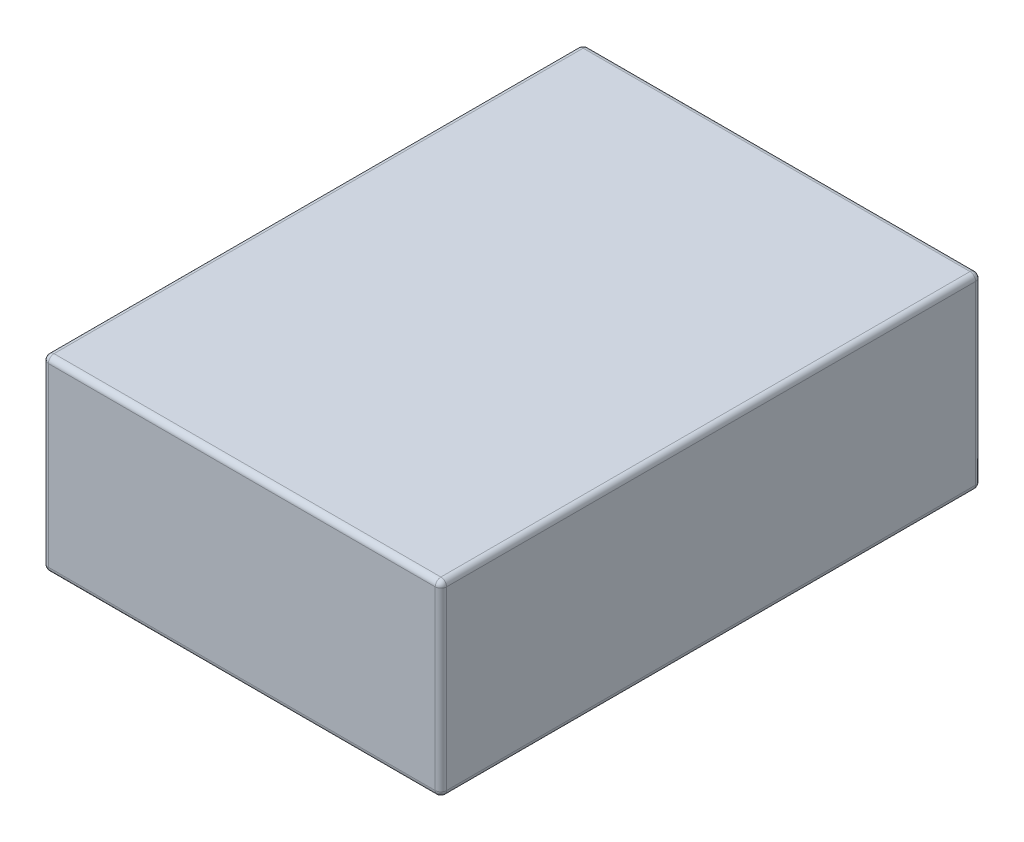
ISO-10303-21;
HEADER;
FILE_DESCRIPTION(('STEP AP214'),'2;1');
FILE_NAME('part.step','',(''),(''),'','','');
FILE_SCHEMA(('AUTOMOTIVE_DESIGN { 1 0 10303 214 1 1 1 1 }'));
ENDSEC;
DATA;
#1=APPLICATION_CONTEXT('core data for automotive mechanical design processes');
#2=APPLICATION_PROTOCOL_DEFINITION('international standard','automotive_design',2000,#1);
#3=PRODUCT_CONTEXT('',#1,'mechanical');
#4=PRODUCT('Part','Part','',(#3));
#5=PRODUCT_RELATED_PRODUCT_CATEGORY('part','',(#4));
#6=PRODUCT_DEFINITION_FORMATION('','',#4);
#7=PRODUCT_DEFINITION_CONTEXT('part definition',#1,'design');
#8=PRODUCT_DEFINITION('design','',#6,#7);
#9=PRODUCT_DEFINITION_SHAPE('','',#8);
#10=(LENGTH_UNIT() NAMED_UNIT(*) SI_UNIT(.MILLI.,.METRE.));
#11=(NAMED_UNIT(*) PLANE_ANGLE_UNIT() SI_UNIT($,.RADIAN.));
#12=(NAMED_UNIT(*) SI_UNIT($,.STERADIAN.) SOLID_ANGLE_UNIT());
#13=UNCERTAINTY_MEASURE_WITH_UNIT(LENGTH_MEASURE(1.E-05),#10,'distance_accuracy_value','');
#14=(GEOMETRIC_REPRESENTATION_CONTEXT(3) GLOBAL_UNCERTAINTY_ASSIGNED_CONTEXT((#13)) GLOBAL_UNIT_ASSIGNED_CONTEXT((#10,
#11,#12)) REPRESENTATION_CONTEXT('',''));
#15=CARTESIAN_POINT('',(0.,0.,0.));
#16=DIRECTION('',(0.,0.,1.));
#17=DIRECTION('',(1.,0.,0.));
#18=AXIS2_PLACEMENT_3D('',#15,#16,#17);
#19=CARTESIAN_POINT('',(0.,33.,0.));
#20=DIRECTION('',(1.,0.,0.));
#21=DIRECTION('',(0.,0.,-1.));
#22=AXIS2_PLACEMENT_3D('',#19,#20,#21);
#23=PLANE('',#22);
#24=DIRECTION('',(0.,-1.,0.));
#25=VECTOR('',#24,1.);
#26=CARTESIAN_POINT('',(0.,33.,-1.));
#27=LINE('',#26,#25);
#28=CARTESIAN_POINT('',(0.,1.,-1.));
#29=VERTEX_POINT('',#28);
#30=CARTESIAN_POINT('',(0.,32.,-1.));
#31=VERTEX_POINT('',#30);
#32=EDGE_CURVE('E140',#29,#31,#27,.F.);
#33=ORIENTED_EDGE('',*,*,#32,.T.);
#34=DIRECTION('',(0.,0.,1.));
#35=VECTOR('',#34,1.);
#36=CARTESIAN_POINT('',(0.,32.,0.));
#37=LINE('',#36,#35);
#38=CARTESIAN_POINT('',(0.,32.,-94.));
#39=VERTEX_POINT('',#38);
#40=EDGE_CURVE('E186',#31,#39,#37,.F.);
#41=ORIENTED_EDGE('',*,*,#40,.T.);
#42=DIRECTION('',(0.,-1.,0.));
#43=VECTOR('',#42,1.);
#44=CARTESIAN_POINT('',(0.,33.,-94.));
#45=LINE('',#44,#43);
#46=CARTESIAN_POINT('',(0.,1.,-94.));
#47=VERTEX_POINT('',#46);
#48=EDGE_CURVE('E181',#39,#47,#45,.T.);
#49=ORIENTED_EDGE('',*,*,#48,.T.);
#50=DIRECTION('',(0.,0.,1.));
#51=VECTOR('',#50,1.);
#52=CARTESIAN_POINT('',(0.,1.,0.));
#53=LINE('',#52,#51);
#54=EDGE_CURVE('E175',#47,#29,#53,.T.);
#55=ORIENTED_EDGE('',*,*,#54,.T.);
#56=EDGE_LOOP('',(#33,#41,#49,#55));
#57=FACE_BOUND('',#56,.T.);
#58=ADVANCED_FACE('F43',(#57),#23,.F.);
#59=CARTESIAN_POINT('',(0.,33.,0.));
#60=DIRECTION('',(0.,0.,-1.));
#61=DIRECTION('',(-1.,0.,0.));
#62=AXIS2_PLACEMENT_3D('',#59,#60,#61);
#63=PLANE('',#62);
#64=DIRECTION('',(0.,-1.,0.));
#65=VECTOR('',#64,1.);
#66=CARTESIAN_POINT('',(69.,33.,0.));
#67=LINE('',#66,#65);
#68=CARTESIAN_POINT('',(69.,1.,0.));
#69=VERTEX_POINT('',#68);
#70=CARTESIAN_POINT('',(69.,32.,0.));
#71=VERTEX_POINT('',#70);
#72=EDGE_CURVE('E165',#69,#71,#67,.F.);
#73=ORIENTED_EDGE('',*,*,#72,.T.);
#74=DIRECTION('',(1.,0.,0.));
#75=VECTOR('',#74,1.);
#76=CARTESIAN_POINT('',(0.,32.,0.));
#77=LINE('',#76,#75);
#78=CARTESIAN_POINT('',(1.,32.,0.));
#79=VERTEX_POINT('',#78);
#80=EDGE_CURVE('E169',#71,#79,#77,.F.);
#81=ORIENTED_EDGE('',*,*,#80,.T.);
#82=DIRECTION('',(0.,-1.,0.));
#83=VECTOR('',#82,1.);
#84=CARTESIAN_POINT('',(1.,33.,0.));
#85=LINE('',#84,#83);
#86=CARTESIAN_POINT('',(1.,1.,0.));
#87=VERTEX_POINT('',#86);
#88=EDGE_CURVE('E138',#79,#87,#85,.T.);
#89=ORIENTED_EDGE('',*,*,#88,.T.);
#90=DIRECTION('',(1.,0.,0.));
#91=VECTOR('',#90,1.);
#92=CARTESIAN_POINT('',(70.,1.,0.));
#93=LINE('',#92,#91);
#94=EDGE_CURVE('E158',#87,#69,#93,.T.);
#95=ORIENTED_EDGE('',*,*,#94,.T.);
#96=EDGE_LOOP('',(#73,#81,#89,#95));
#97=FACE_BOUND('',#96,.T.);
#98=ADVANCED_FACE('F167',(#97),#63,.F.);
#99=CARTESIAN_POINT('',(70.,33.,0.));
#100=DIRECTION('',(-1.,0.,0.));
#101=DIRECTION('',(0.,0.,1.));
#102=AXIS2_PLACEMENT_3D('',#99,#100,#101);
#103=PLANE('',#102);
#104=DIRECTION('',(0.,-1.,0.));
#105=VECTOR('',#104,1.);
#106=CARTESIAN_POINT('',(70.,33.,-94.));
#107=LINE('',#106,#105);
#108=CARTESIAN_POINT('',(70.,1.,-94.));
#109=VERTEX_POINT('',#108);
#110=CARTESIAN_POINT('',(70.,32.,-94.));
#111=VERTEX_POINT('',#110);
#112=EDGE_CURVE('E192',#109,#111,#107,.F.);
#113=ORIENTED_EDGE('',*,*,#112,.T.);
#114=DIRECTION('',(0.,0.,-1.));
#115=VECTOR('',#114,1.);
#116=CARTESIAN_POINT('',(70.,32.,0.));
#117=LINE('',#116,#115);
#118=CARTESIAN_POINT('',(70.,32.,-1.));
#119=VERTEX_POINT('',#118);
#120=EDGE_CURVE('E199',#111,#119,#117,.F.);
#121=ORIENTED_EDGE('',*,*,#120,.T.);
#122=DIRECTION('',(0.,-1.,0.));
#123=VECTOR('',#122,1.);
#124=CARTESIAN_POINT('',(70.,33.,-1.));
#125=LINE('',#124,#123);
#126=CARTESIAN_POINT('',(70.,1.,-1.));
#127=VERTEX_POINT('',#126);
#128=EDGE_CURVE('E195',#119,#127,#125,.T.);
#129=ORIENTED_EDGE('',*,*,#128,.T.);
#130=DIRECTION('',(0.,0.,-1.));
#131=VECTOR('',#130,1.);
#132=CARTESIAN_POINT('',(70.,1.,-95.));
#133=LINE('',#132,#131);
#134=EDGE_CURVE('E189',#127,#109,#133,.T.);
#135=ORIENTED_EDGE('',*,*,#134,.T.);
#136=EDGE_LOOP('',(#113,#121,#129,#135));
#137=FACE_BOUND('',#136,.T.);
#138=ADVANCED_FACE('F338',(#137),#103,.F.);
#139=CARTESIAN_POINT('',(0.,33.,-95.));
#140=DIRECTION('',(0.,0.,1.));
#141=DIRECTION('',(1.,0.,0.));
#142=AXIS2_PLACEMENT_3D('',#139,#140,#141);
#143=PLANE('',#142);
#144=DIRECTION('',(0.,-1.,0.));
#145=VECTOR('',#144,1.);
#146=CARTESIAN_POINT('',(1.,33.,-95.));
#147=LINE('',#146,#145);
#148=CARTESIAN_POINT('',(1.,1.,-95.));
#149=VERTEX_POINT('',#148);
#150=CARTESIAN_POINT('',(1.,32.,-95.));
#151=VERTEX_POINT('',#150);
#152=EDGE_CURVE('E205',#149,#151,#147,.F.);
#153=ORIENTED_EDGE('',*,*,#152,.T.);
#154=DIRECTION('',(-1.,0.,0.));
#155=VECTOR('',#154,1.);
#156=CARTESIAN_POINT('',(0.,32.,-95.));
#157=LINE('',#156,#155);
#158=CARTESIAN_POINT('',(69.,32.,-95.));
#159=VERTEX_POINT('',#158);
#160=EDGE_CURVE('E212',#151,#159,#157,.F.);
#161=ORIENTED_EDGE('',*,*,#160,.T.);
#162=DIRECTION('',(0.,-1.,0.));
#163=VECTOR('',#162,1.);
#164=CARTESIAN_POINT('',(69.,33.,-95.));
#165=LINE('',#164,#163);
#166=CARTESIAN_POINT('',(69.,1.,-95.));
#167=VERTEX_POINT('',#166);
#168=EDGE_CURVE('E208',#159,#167,#165,.T.);
#169=ORIENTED_EDGE('',*,*,#168,.T.);
#170=DIRECTION('',(-1.,0.,0.));
#171=VECTOR('',#170,1.);
#172=CARTESIAN_POINT('',(0.,1.,-95.));
#173=LINE('',#172,#171);
#174=EDGE_CURVE('E202',#167,#149,#173,.T.);
#175=ORIENTED_EDGE('',*,*,#174,.T.);
#176=EDGE_LOOP('',(#153,#161,#169,#175));
#177=FACE_BOUND('',#176,.T.);
#178=ADVANCED_FACE('F349',(#177),#143,.F.);
#179=CARTESIAN_POINT('',(0.,33.,0.));
#180=DIRECTION('',(0.,-1.,0.));
#181=DIRECTION('',(0.,0.,-1.));
#182=AXIS2_PLACEMENT_3D('',#179,#180,#181);
#183=PLANE('',#182);
#184=DIRECTION('',(0.,0.,-1.));
#185=VECTOR('',#184,1.);
#186=CARTESIAN_POINT('',(69.,33.,0.));
#187=LINE('',#186,#185);
#188=CARTESIAN_POINT('',(69.,33.,-1.));
#189=VERTEX_POINT('',#188);
#190=CARTESIAN_POINT('',(69.,33.,-94.));
#191=VERTEX_POINT('',#190);
#192=EDGE_CURVE('E221',#189,#191,#187,.T.);
#193=ORIENTED_EDGE('',*,*,#192,.T.);
#194=DIRECTION('',(-1.,0.,0.));
#195=VECTOR('',#194,1.);
#196=CARTESIAN_POINT('',(0.,33.,-94.));
#197=LINE('',#196,#195);
#198=CARTESIAN_POINT('',(1.,33.,-94.));
#199=VERTEX_POINT('',#198);
#200=EDGE_CURVE('E224',#191,#199,#197,.T.);
#201=ORIENTED_EDGE('',*,*,#200,.T.);
#202=DIRECTION('',(0.,0.,1.));
#203=VECTOR('',#202,1.);
#204=CARTESIAN_POINT('',(1.,33.,0.));
#205=LINE('',#204,#203);
#206=CARTESIAN_POINT('',(1.,33.,-1.));
#207=VERTEX_POINT('',#206);
#208=EDGE_CURVE('E215',#199,#207,#205,.T.);
#209=ORIENTED_EDGE('',*,*,#208,.T.);
#210=DIRECTION('',(1.,0.,0.));
#211=VECTOR('',#210,1.);
#212=CARTESIAN_POINT('',(0.,33.,-1.));
#213=LINE('',#212,#211);
#214=EDGE_CURVE('E218',#207,#189,#213,.T.);
#215=ORIENTED_EDGE('',*,*,#214,.T.);
#216=EDGE_LOOP('',(#193,#201,#209,#215));
#217=FACE_BOUND('',#216,.T.);
#218=ADVANCED_FACE('F330',(#217),#183,.F.);
#219=CARTESIAN_POINT('',(0.,0.,0.));
#220=DIRECTION('',(0.,-1.,0.));
#221=DIRECTION('',(0.,0.,-1.));
#222=AXIS2_PLACEMENT_3D('',#219,#220,#221);
#223=PLANE('',#222);
#224=DIRECTION('',(0.,0.,-1.));
#225=VECTOR('',#224,1.);
#226=CARTESIAN_POINT('',(69.,0.,0.));
#227=LINE('',#226,#225);
#228=CARTESIAN_POINT('',(69.,0.,-94.));
#229=VERTEX_POINT('',#228);
#230=CARTESIAN_POINT('',(69.,0.,-1.));
#231=VERTEX_POINT('',#230);
#232=EDGE_CURVE('E53',#229,#231,#227,.F.);
#233=ORIENTED_EDGE('',*,*,#232,.T.);
#234=DIRECTION('',(1.,0.,0.));
#235=VECTOR('',#234,1.);
#236=CARTESIAN_POINT('',(0.,0.,-1.));
#237=LINE('',#236,#235);
#238=CARTESIAN_POINT('',(1.,0.,-1.));
#239=VERTEX_POINT('',#238);
#240=EDGE_CURVE('E12',#231,#239,#237,.F.);
#241=ORIENTED_EDGE('',*,*,#240,.T.);
#242=DIRECTION('',(0.,0.,1.));
#243=VECTOR('',#242,1.);
#244=CARTESIAN_POINT('',(1.,0.,-95.));
#245=LINE('',#244,#243);
#246=CARTESIAN_POINT('',(1.,0.,-94.));
#247=VERTEX_POINT('',#246);
#248=EDGE_CURVE('E228',#239,#247,#245,.F.);
#249=ORIENTED_EDGE('',*,*,#248,.T.);
#250=DIRECTION('',(-1.,0.,0.));
#251=VECTOR('',#250,1.);
#252=CARTESIAN_POINT('',(70.,0.,-94.));
#253=LINE('',#252,#251);
#254=EDGE_CURVE('E64',#247,#229,#253,.F.);
#255=ORIENTED_EDGE('',*,*,#254,.T.);
#256=EDGE_LOOP('',(#233,#241,#249,#255));
#257=FACE_BOUND('',#256,.T.);
#258=ADVANCED_FACE('F452',(#257),#223,.T.);
#259=CARTESIAN_POINT('',(69.,33.,-94.));
#260=DIRECTION('',(0.,-1.,0.));
#261=DIRECTION('',(0.,0.,-1.));
#262=AXIS2_PLACEMENT_3D('',#259,#260,#261);
#263=CYLINDRICAL_SURFACE('',#262,1.);
#264=CARTESIAN_POINT('',(69.,32.,-94.));
#265=DIRECTION('',(0.,1.,0.));
#266=DIRECTION('',(0.,0.,1.));
#267=AXIS2_PLACEMENT_3D('',#264,#265,#266);
#268=CIRCLE('',#267,1.);
#269=EDGE_CURVE('E47',#111,#159,#268,.T.);
#270=ORIENTED_EDGE('',*,*,#269,.F.);
#271=ORIENTED_EDGE('',*,*,#112,.F.);
#272=CARTESIAN_POINT('',(69.,1.,-94.));
#273=DIRECTION('',(0.,-1.,0.));
#274=DIRECTION('',(0.,0.,-1.));
#275=AXIS2_PLACEMENT_3D('',#272,#273,#274);
#276=CIRCLE('',#275,1.);
#277=EDGE_CURVE('E305',#167,#109,#276,.T.);
#278=ORIENTED_EDGE('',*,*,#277,.F.);
#279=ORIENTED_EDGE('',*,*,#168,.F.);
#280=EDGE_LOOP('',(#270,#271,#278,#279));
#281=FACE_BOUND('',#280,.T.);
#282=ADVANCED_FACE('F45',(#281),#263,.T.);
#283=CARTESIAN_POINT('',(69.,32.,-94.));
#284=DIRECTION('',(0.,0.,-1.));
#285=DIRECTION('',(-1.,0.,0.));
#286=AXIS2_PLACEMENT_3D('',#283,#284,#285);
#287=SPHERICAL_SURFACE('',#286,1.);
#288=CARTESIAN_POINT('',(69.,32.,-94.));
#289=DIRECTION('',(0.,0.,-1.));
#290=DIRECTION('',(-1.,0.,0.));
#291=AXIS2_PLACEMENT_3D('',#288,#289,#290);
#292=CIRCLE('',#291,1.);
#293=EDGE_CURVE('E298',#111,#191,#292,.F.);
#294=ORIENTED_EDGE('',*,*,#293,.F.);
#295=ORIENTED_EDGE('',*,*,#269,.T.);
#296=CARTESIAN_POINT('',(69.,32.,-94.));
#297=DIRECTION('',(1.,0.,0.));
#298=DIRECTION('',(0.,0.,-1.));
#299=AXIS2_PLACEMENT_3D('',#296,#297,#298);
#300=CIRCLE('',#299,1.);
#301=EDGE_CURVE('E302',#191,#159,#300,.F.);
#302=ORIENTED_EDGE('',*,*,#301,.F.);
#303=EDGE_LOOP('',(#294,#295,#302));
#304=FACE_BOUND('',#303,.T.);
#305=ADVANCED_FACE('F318',(#304),#287,.T.);
#306=CARTESIAN_POINT('',(69.,1.,-94.));
#307=DIRECTION('',(1.,0.,0.));
#308=DIRECTION('',(0.,1.,0.));
#309=AXIS2_PLACEMENT_3D('',#306,#307,#308);
#310=SPHERICAL_SURFACE('',#309,1.);
#311=CARTESIAN_POINT('',(69.,1.,-94.));
#312=DIRECTION('',(1.,0.,0.));
#313=DIRECTION('',(0.,0.,-1.));
#314=AXIS2_PLACEMENT_3D('',#311,#312,#313);
#315=CIRCLE('',#314,1.);
#316=EDGE_CURVE('E291',#167,#229,#315,.F.);
#317=ORIENTED_EDGE('',*,*,#316,.F.);
#318=ORIENTED_EDGE('',*,*,#277,.T.);
#319=CARTESIAN_POINT('',(69.,1.,-94.));
#320=DIRECTION('',(0.,0.,-1.));
#321=DIRECTION('',(-1.,0.,0.));
#322=AXIS2_PLACEMENT_3D('',#319,#320,#321);
#323=CIRCLE('',#322,1.);
#324=EDGE_CURVE('E294',#229,#109,#323,.F.);
#325=ORIENTED_EDGE('',*,*,#324,.F.);
#326=EDGE_LOOP('',(#317,#318,#325));
#327=FACE_BOUND('',#326,.T.);
#328=ADVANCED_FACE('F499',(#327),#310,.T.);
#329=CARTESIAN_POINT('',(0.,32.,-94.));
#330=DIRECTION('',(-1.,0.,0.));
#331=DIRECTION('',(0.,0.,1.));
#332=AXIS2_PLACEMENT_3D('',#329,#330,#331);
#333=CYLINDRICAL_SURFACE('',#332,1.);
#334=ORIENTED_EDGE('',*,*,#301,.T.);
#335=ORIENTED_EDGE('',*,*,#160,.F.);
#336=CARTESIAN_POINT('',(1.,32.,-94.));
#337=DIRECTION('',(-1.,0.,0.));
#338=DIRECTION('',(0.,0.,1.));
#339=AXIS2_PLACEMENT_3D('',#336,#337,#338);
#340=CIRCLE('',#339,1.);
#341=EDGE_CURVE('E283',#199,#151,#340,.T.);
#342=ORIENTED_EDGE('',*,*,#341,.F.);
#343=ORIENTED_EDGE('',*,*,#200,.F.);
#344=EDGE_LOOP('',(#334,#335,#342,#343));
#345=FACE_BOUND('',#344,.T.);
#346=ADVANCED_FACE('F326',(#345),#333,.T.);
#347=CARTESIAN_POINT('',(69.,32.,0.));
#348=DIRECTION('',(0.,0.,-1.));
#349=DIRECTION('',(-1.,0.,0.));
#350=AXIS2_PLACEMENT_3D('',#347,#348,#349);
#351=CYLINDRICAL_SURFACE('',#350,1.);
#352=ORIENTED_EDGE('',*,*,#293,.T.);
#353=ORIENTED_EDGE('',*,*,#192,.F.);
#354=CARTESIAN_POINT('',(69.,32.,-1.));
#355=DIRECTION('',(0.,0.,1.));
#356=DIRECTION('',(1.,0.,0.));
#357=AXIS2_PLACEMENT_3D('',#354,#355,#356);
#358=CIRCLE('',#357,1.);
#359=EDGE_CURVE('E279',#119,#189,#358,.T.);
#360=ORIENTED_EDGE('',*,*,#359,.F.);
#361=ORIENTED_EDGE('',*,*,#120,.F.);
#362=EDGE_LOOP('',(#352,#353,#360,#361));
#363=FACE_BOUND('',#362,.T.);
#364=ADVANCED_FACE('F335',(#363),#351,.T.);
#365=CARTESIAN_POINT('',(69.,33.,-1.));
#366=DIRECTION('',(0.,-1.,0.));
#367=DIRECTION('',(0.,0.,-1.));
#368=AXIS2_PLACEMENT_3D('',#365,#366,#367);
#369=CYLINDRICAL_SURFACE('',#368,1.);
#370=CARTESIAN_POINT('',(69.,1.,-1.));
#371=DIRECTION('',(0.,-1.,0.));
#372=DIRECTION('',(0.,0.,-1.));
#373=AXIS2_PLACEMENT_3D('',#370,#371,#372);
#374=CIRCLE('',#373,1.);
#375=EDGE_CURVE('E271',#127,#69,#374,.T.);
#376=ORIENTED_EDGE('',*,*,#375,.F.);
#377=ORIENTED_EDGE('',*,*,#128,.F.);
#378=CARTESIAN_POINT('',(69.,32.,-1.));
#379=DIRECTION('',(0.,1.,0.));
#380=DIRECTION('',(0.,0.,1.));
#381=AXIS2_PLACEMENT_3D('',#378,#379,#380);
#382=CIRCLE('',#381,1.);
#383=EDGE_CURVE('E275',#71,#119,#382,.T.);
#384=ORIENTED_EDGE('',*,*,#383,.F.);
#385=ORIENTED_EDGE('',*,*,#72,.F.);
#386=EDGE_LOOP('',(#376,#377,#384,#385));
#387=FACE_BOUND('',#386,.T.);
#388=ADVANCED_FACE('F342',(#387),#369,.T.);
#389=CARTESIAN_POINT('',(69.,1.,0.));
#390=DIRECTION('',(0.,0.,1.));
#391=DIRECTION('',(1.,0.,0.));
#392=AXIS2_PLACEMENT_3D('',#389,#390,#391);
#393=CYLINDRICAL_SURFACE('',#392,1.);
#394=ORIENTED_EDGE('',*,*,#324,.T.);
#395=ORIENTED_EDGE('',*,*,#134,.F.);
#396=CARTESIAN_POINT('',(69.,1.,-1.));
#397=DIRECTION('',(0.,0.,1.));
#398=DIRECTION('',(1.,0.,0.));
#399=AXIS2_PLACEMENT_3D('',#396,#397,#398);
#400=CIRCLE('',#399,1.);
#401=EDGE_CURVE('E268',#231,#127,#400,.T.);
#402=ORIENTED_EDGE('',*,*,#401,.F.);
#403=ORIENTED_EDGE('',*,*,#232,.F.);
#404=EDGE_LOOP('',(#394,#395,#402,#403));
#405=FACE_BOUND('',#404,.T.);
#406=ADVANCED_FACE('F347',(#405),#393,.T.);
#407=CARTESIAN_POINT('',(0.,1.,-94.));
#408=DIRECTION('',(1.,0.,0.));
#409=DIRECTION('',(0.,0.,-1.));
#410=AXIS2_PLACEMENT_3D('',#407,#408,#409);
#411=CYLINDRICAL_SURFACE('',#410,1.);
#412=ORIENTED_EDGE('',*,*,#316,.T.);
#413=ORIENTED_EDGE('',*,*,#254,.F.);
#414=CARTESIAN_POINT('',(1.,1.,-94.));
#415=DIRECTION('',(-1.,0.,0.));
#416=DIRECTION('',(0.,0.,1.));
#417=AXIS2_PLACEMENT_3D('',#414,#415,#416);
#418=CIRCLE('',#417,1.);
#419=EDGE_CURVE('E264',#149,#247,#418,.T.);
#420=ORIENTED_EDGE('',*,*,#419,.F.);
#421=ORIENTED_EDGE('',*,*,#174,.F.);
#422=EDGE_LOOP('',(#412,#413,#420,#421));
#423=FACE_BOUND('',#422,.T.);
#424=ADVANCED_FACE('F358',(#423),#411,.T.);
#425=CARTESIAN_POINT('',(1.,33.,-94.));
#426=DIRECTION('',(0.,-1.,0.));
#427=DIRECTION('',(0.,0.,-1.));
#428=AXIS2_PLACEMENT_3D('',#425,#426,#427);
#429=CYLINDRICAL_SURFACE('',#428,1.);
#430=CARTESIAN_POINT('',(1.,32.,-94.));
#431=DIRECTION('',(0.,1.,0.));
#432=DIRECTION('',(0.,0.,1.));
#433=AXIS2_PLACEMENT_3D('',#430,#431,#432);
#434=CIRCLE('',#433,1.);
#435=EDGE_CURVE('E287',#151,#39,#434,.T.);
#436=ORIENTED_EDGE('',*,*,#435,.F.);
#437=ORIENTED_EDGE('',*,*,#152,.F.);
#438=CARTESIAN_POINT('',(1.,1.,-94.));
#439=DIRECTION('',(0.,-1.,0.));
#440=DIRECTION('',(0.,0.,-1.));
#441=AXIS2_PLACEMENT_3D('',#438,#439,#440);
#442=CIRCLE('',#441,1.);
#443=EDGE_CURVE('E260',#47,#149,#442,.T.);
#444=ORIENTED_EDGE('',*,*,#443,.F.);
#445=ORIENTED_EDGE('',*,*,#48,.F.);
#446=EDGE_LOOP('',(#436,#437,#444,#445));
#447=FACE_BOUND('',#446,.T.);
#448=ADVANCED_FACE('F354',(#447),#429,.T.);
#449=CARTESIAN_POINT('',(1.,32.,-94.));
#450=DIRECTION('',(0.,0.,-1.));
#451=DIRECTION('',(-1.,0.,0.));
#452=AXIS2_PLACEMENT_3D('',#449,#450,#451);
#453=SPHERICAL_SURFACE('',#452,1.);
#454=ORIENTED_EDGE('',*,*,#341,.T.);
#455=ORIENTED_EDGE('',*,*,#435,.T.);
#456=CARTESIAN_POINT('',(1.,32.,-94.));
#457=DIRECTION('',(0.,0.,-1.));
#458=DIRECTION('',(-1.,0.,0.));
#459=AXIS2_PLACEMENT_3D('',#456,#457,#458);
#460=CIRCLE('',#459,1.);
#461=EDGE_CURVE('E256',#199,#39,#460,.F.);
#462=ORIENTED_EDGE('',*,*,#461,.F.);
#463=EDGE_LOOP('',(#454,#455,#462));
#464=FACE_BOUND('',#463,.T.);
#465=ADVANCED_FACE('F368',(#464),#453,.T.);
#466=CARTESIAN_POINT('',(69.,32.,-1.));
#467=DIRECTION('',(1.,0.,0.));
#468=DIRECTION('',(0.,0.,-1.));
#469=AXIS2_PLACEMENT_3D('',#466,#467,#468);
#470=SPHERICAL_SURFACE('',#469,1.);
#471=ORIENTED_EDGE('',*,*,#383,.T.);
#472=ORIENTED_EDGE('',*,*,#359,.T.);
#473=CARTESIAN_POINT('',(69.,32.,-1.));
#474=DIRECTION('',(1.,0.,0.));
#475=DIRECTION('',(0.,0.,-1.));
#476=AXIS2_PLACEMENT_3D('',#473,#474,#475);
#477=CIRCLE('',#476,1.);
#478=EDGE_CURVE('E252',#71,#189,#477,.F.);
#479=ORIENTED_EDGE('',*,*,#478,.F.);
#480=EDGE_LOOP('',(#471,#472,#479));
#481=FACE_BOUND('',#480,.T.);
#482=ADVANCED_FACE('F378',(#481),#470,.T.);
#483=CARTESIAN_POINT('',(69.,1.,-1.));
#484=DIRECTION('',(1.,0.,0.));
#485=DIRECTION('',(0.,1.,0.));
#486=AXIS2_PLACEMENT_3D('',#483,#484,#485);
#487=SPHERICAL_SURFACE('',#486,1.);
#488=ORIENTED_EDGE('',*,*,#401,.T.);
#489=ORIENTED_EDGE('',*,*,#375,.T.);
#490=CARTESIAN_POINT('',(69.,1.,-1.));
#491=DIRECTION('',(1.,0.,0.));
#492=DIRECTION('',(0.,0.,-1.));
#493=AXIS2_PLACEMENT_3D('',#490,#491,#492);
#494=CIRCLE('',#493,1.);
#495=EDGE_CURVE('E161',#231,#69,#494,.F.);
#496=ORIENTED_EDGE('',*,*,#495,.F.);
#497=EDGE_LOOP('',(#488,#489,#496));
#498=FACE_BOUND('',#497,.T.);
#499=ADVANCED_FACE('F380',(#498),#487,.T.);
#500=CARTESIAN_POINT('',(1.,1.,-94.));
#501=DIRECTION('',(0.,0.,-1.));
#502=DIRECTION('',(0.,1.,0.));
#503=AXIS2_PLACEMENT_3D('',#500,#501,#502);
#504=SPHERICAL_SURFACE('',#503,1.);
#505=ORIENTED_EDGE('',*,*,#443,.T.);
#506=ORIENTED_EDGE('',*,*,#419,.T.);
#507=CARTESIAN_POINT('',(1.,1.,-94.));
#508=DIRECTION('',(0.,0.,-1.));
#509=DIRECTION('',(-1.,0.,0.));
#510=AXIS2_PLACEMENT_3D('',#507,#508,#509);
#511=CIRCLE('',#510,1.);
#512=EDGE_CURVE('E246',#47,#247,#511,.F.);
#513=ORIENTED_EDGE('',*,*,#512,.F.);
#514=EDGE_LOOP('',(#505,#506,#513));
#515=FACE_BOUND('',#514,.T.);
#516=ADVANCED_FACE('F360',(#515),#504,.T.);
#517=CARTESIAN_POINT('',(1.,32.,0.));
#518=DIRECTION('',(0.,0.,1.));
#519=DIRECTION('',(1.,0.,0.));
#520=AXIS2_PLACEMENT_3D('',#517,#518,#519);
#521=CYLINDRICAL_SURFACE('',#520,1.);
#522=ORIENTED_EDGE('',*,*,#461,.T.);
#523=ORIENTED_EDGE('',*,*,#40,.F.);
#524=CARTESIAN_POINT('',(1.,32.,-1.));
#525=DIRECTION('',(0.,0.,1.));
#526=DIRECTION('',(1.,0.,0.));
#527=AXIS2_PLACEMENT_3D('',#524,#525,#526);
#528=CIRCLE('',#527,1.);
#529=EDGE_CURVE('E242',#207,#31,#528,.T.);
#530=ORIENTED_EDGE('',*,*,#529,.F.);
#531=ORIENTED_EDGE('',*,*,#208,.F.);
#532=EDGE_LOOP('',(#522,#523,#530,#531));
#533=FACE_BOUND('',#532,.T.);
#534=ADVANCED_FACE('F370',(#533),#521,.T.);
#535=CARTESIAN_POINT('',(0.,32.,-1.));
#536=DIRECTION('',(1.,0.,0.));
#537=DIRECTION('',(0.,0.,-1.));
#538=AXIS2_PLACEMENT_3D('',#535,#536,#537);
#539=CYLINDRICAL_SURFACE('',#538,1.);
#540=ORIENTED_EDGE('',*,*,#478,.T.);
#541=ORIENTED_EDGE('',*,*,#214,.F.);
#542=CARTESIAN_POINT('',(1.,32.,-1.));
#543=DIRECTION('',(-1.,0.,0.));
#544=DIRECTION('',(0.,0.,1.));
#545=AXIS2_PLACEMENT_3D('',#542,#543,#544);
#546=CIRCLE('',#545,1.);
#547=EDGE_CURVE('E155',#79,#207,#546,.T.);
#548=ORIENTED_EDGE('',*,*,#547,.F.);
#549=ORIENTED_EDGE('',*,*,#80,.F.);
#550=EDGE_LOOP('',(#540,#541,#548,#549));
#551=FACE_BOUND('',#550,.T.);
#552=ADVANCED_FACE('F376',(#551),#539,.T.);
#553=CARTESIAN_POINT('',(0.,1.,-1.));
#554=DIRECTION('',(-1.,0.,0.));
#555=DIRECTION('',(0.,0.,1.));
#556=AXIS2_PLACEMENT_3D('',#553,#554,#555);
#557=CYLINDRICAL_SURFACE('',#556,1.);
#558=ORIENTED_EDGE('',*,*,#495,.T.);
#559=ORIENTED_EDGE('',*,*,#94,.F.);
#560=CARTESIAN_POINT('',(1.,1.,-1.));
#561=DIRECTION('',(-1.,0.,0.));
#562=DIRECTION('',(0.,0.,1.));
#563=AXIS2_PLACEMENT_3D('',#560,#561,#562);
#564=CIRCLE('',#563,1.);
#565=EDGE_CURVE('E146',#239,#87,#564,.T.);
#566=ORIENTED_EDGE('',*,*,#565,.F.);
#567=ORIENTED_EDGE('',*,*,#240,.F.);
#568=EDGE_LOOP('',(#558,#559,#566,#567));
#569=FACE_BOUND('',#568,.T.);
#570=ADVANCED_FACE('F159',(#569),#557,.T.);
#571=CARTESIAN_POINT('',(1.,1.,0.));
#572=DIRECTION('',(0.,0.,-1.));
#573=DIRECTION('',(-1.,0.,0.));
#574=AXIS2_PLACEMENT_3D('',#571,#572,#573);
#575=CYLINDRICAL_SURFACE('',#574,1.);
#576=ORIENTED_EDGE('',*,*,#512,.T.);
#577=ORIENTED_EDGE('',*,*,#248,.F.);
#578=CARTESIAN_POINT('',(1.,1.,-1.));
#579=DIRECTION('',(0.,0.,1.));
#580=DIRECTION('',(1.,0.,0.));
#581=AXIS2_PLACEMENT_3D('',#578,#579,#580);
#582=CIRCLE('',#581,1.);
#583=EDGE_CURVE('E150',#29,#239,#582,.T.);
#584=ORIENTED_EDGE('',*,*,#583,.F.);
#585=ORIENTED_EDGE('',*,*,#54,.F.);
#586=EDGE_LOOP('',(#576,#577,#584,#585));
#587=FACE_BOUND('',#586,.T.);
#588=ADVANCED_FACE('F363',(#587),#575,.T.);
#589=CARTESIAN_POINT('',(1.,32.,-1.));
#590=DIRECTION('',(0.,1.,0.));
#591=DIRECTION('',(0.,0.,1.));
#592=AXIS2_PLACEMENT_3D('',#589,#590,#591);
#593=SPHERICAL_SURFACE('',#592,1.);
#594=ORIENTED_EDGE('',*,*,#547,.T.);
#595=ORIENTED_EDGE('',*,*,#529,.T.);
#596=CARTESIAN_POINT('',(1.,32.,-1.));
#597=DIRECTION('',(0.,1.,0.));
#598=DIRECTION('',(0.,0.,1.));
#599=AXIS2_PLACEMENT_3D('',#596,#597,#598);
#600=CIRCLE('',#599,1.);
#601=EDGE_CURVE('E143',#79,#31,#600,.F.);
#602=ORIENTED_EDGE('',*,*,#601,.F.);
#603=EDGE_LOOP('',(#594,#595,#602));
#604=FACE_BOUND('',#603,.T.);
#605=ADVANCED_FACE('F374',(#604),#593,.T.);
#606=CARTESIAN_POINT('',(1.,1.,-1.));
#607=DIRECTION('',(0.,-1.,0.));
#608=DIRECTION('',(0.,0.,-1.));
#609=AXIS2_PLACEMENT_3D('',#606,#607,#608);
#610=SPHERICAL_SURFACE('',#609,1.);
#611=ORIENTED_EDGE('',*,*,#583,.T.);
#612=ORIENTED_EDGE('',*,*,#565,.T.);
#613=CARTESIAN_POINT('',(1.,1.,-1.));
#614=DIRECTION('',(0.,-1.,0.));
#615=DIRECTION('',(0.,0.,-1.));
#616=AXIS2_PLACEMENT_3D('',#613,#614,#615);
#617=CIRCLE('',#616,1.);
#618=EDGE_CURVE('E134',#29,#87,#617,.F.);
#619=ORIENTED_EDGE('',*,*,#618,.F.);
#620=EDGE_LOOP('',(#611,#612,#619));
#621=FACE_BOUND('',#620,.T.);
#622=ADVANCED_FACE('F148',(#621),#610,.T.);
#623=CARTESIAN_POINT('',(1.,33.,-1.));
#624=DIRECTION('',(0.,-1.,0.));
#625=DIRECTION('',(0.,0.,-1.));
#626=AXIS2_PLACEMENT_3D('',#623,#624,#625);
#627=CYLINDRICAL_SURFACE('',#626,1.);
#628=ORIENTED_EDGE('',*,*,#601,.T.);
#629=ORIENTED_EDGE('',*,*,#32,.F.);
#630=ORIENTED_EDGE('',*,*,#618,.T.);
#631=ORIENTED_EDGE('',*,*,#88,.F.);
#632=EDGE_LOOP('',(#628,#629,#630,#631));
#633=FACE_BOUND('',#632,.T.);
#634=ADVANCED_FACE('F136',(#633),#627,.T.);
#635=CLOSED_SHELL('',(#58,#98,#138,#178,#218,#258,#282,#305,#328,#346,#364,#388,#406,#424,#448,
#465,#482,#499,#516,#534,#552,#570,#588,#605,#622,#634));
#636=MANIFOLD_SOLID_BREP('B2',#635);
#637=ADVANCED_BREP_SHAPE_REPRESENTATION('',(#18,#636),#14);
#638=SHAPE_DEFINITION_REPRESENTATION(#9,#637);
ENDSEC;
END-ISO-10303-21;
